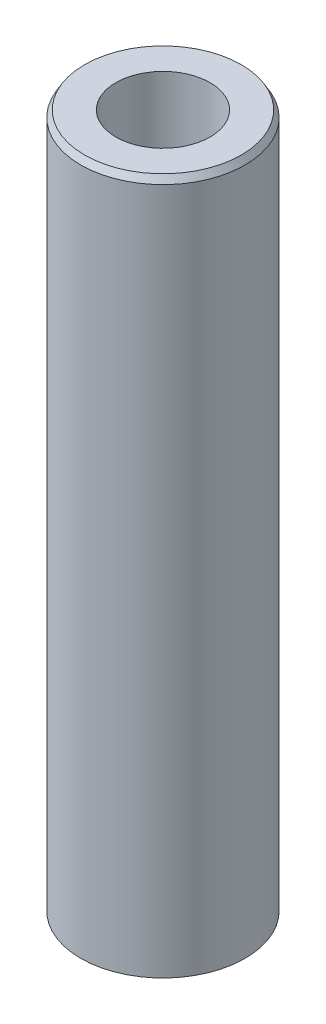
ISO-10303-21;
HEADER;
FILE_DESCRIPTION(('STEP AP214'),'2;1');
FILE_NAME('part.step','',(''),(''),'','','');
FILE_SCHEMA(('AUTOMOTIVE_DESIGN { 1 0 10303 214 1 1 1 1 }'));
ENDSEC;
DATA;
#1=APPLICATION_CONTEXT('core data for automotive mechanical design processes');
#2=APPLICATION_PROTOCOL_DEFINITION('international standard','automotive_design',2000,#1);
#3=PRODUCT_CONTEXT('',#1,'mechanical');
#4=PRODUCT('Part','Part','',(#3));
#5=PRODUCT_RELATED_PRODUCT_CATEGORY('part','',(#4));
#6=PRODUCT_DEFINITION_FORMATION('','',#4);
#7=PRODUCT_DEFINITION_CONTEXT('part definition',#1,'design');
#8=PRODUCT_DEFINITION('design','',#6,#7);
#9=PRODUCT_DEFINITION_SHAPE('','',#8);
#10=(LENGTH_UNIT() NAMED_UNIT(*) SI_UNIT(.MILLI.,.METRE.));
#11=(NAMED_UNIT(*) PLANE_ANGLE_UNIT() SI_UNIT($,.RADIAN.));
#12=(NAMED_UNIT(*) SI_UNIT($,.STERADIAN.) SOLID_ANGLE_UNIT());
#13=UNCERTAINTY_MEASURE_WITH_UNIT(LENGTH_MEASURE(1.E-05),#10,'distance_accuracy_value','');
#14=(GEOMETRIC_REPRESENTATION_CONTEXT(3) GLOBAL_UNCERTAINTY_ASSIGNED_CONTEXT((#13)) GLOBAL_UNIT_ASSIGNED_CONTEXT((#10,
#11,#12)) REPRESENTATION_CONTEXT('',''));
#15=CARTESIAN_POINT('',(0.,0.,0.));
#16=DIRECTION('',(0.,0.,1.));
#17=DIRECTION('',(1.,0.,0.));
#18=AXIS2_PLACEMENT_3D('',#15,#16,#17);
#19=CARTESIAN_POINT('',(0.,488.098273099649,0.));
#20=DIRECTION('',(0.,-1.,0.));
#21=DIRECTION('',(0.,0.,-1.));
#22=AXIS2_PLACEMENT_3D('',#19,#20,#21);
#23=CYLINDRICAL_SURFACE('',#22,57.5);
#24=CARTESIAN_POINT('',(0.,483.416938050981,0.));
#25=DIRECTION('',(0.,1.,0.));
#26=DIRECTION('',(0.,0.,1.));
#27=AXIS2_PLACEMENT_3D('',#24,#25,#26);
#28=CIRCLE('',#27,57.5);
#29=CARTESIAN_POINT('',(0.,483.416938050981,57.5));
#30=VERTEX_POINT('',#29);
#31=EDGE_CURVE('E50',#30,#30,#28,.F.);
#32=ORIENTED_EDGE('',*,*,#31,.T.);
#33=EDGE_LOOP('',(#32));
#34=FACE_BOUND('',#33,.T.);
#35=CARTESIAN_POINT('',(0.,2.70277005051539,0.));
#36=DIRECTION('',(0.,1.,0.));
#37=DIRECTION('',(0.,0.,1.));
#38=AXIS2_PLACEMENT_3D('',#35,#36,#37);
#39=CIRCLE('',#38,57.5);
#40=CARTESIAN_POINT('',(0.,2.70277005051539,57.5));
#41=VERTEX_POINT('',#40);
#42=EDGE_CURVE('E51',#41,#41,#39,.T.);
#43=ORIENTED_EDGE('',*,*,#42,.T.);
#44=EDGE_LOOP('',(#43));
#45=FACE_BOUND('',#44,.T.);
#46=ADVANCED_FACE('F39',(#34,#45),#23,.T.);
#47=CARTESIAN_POINT('',(0.,488.098273099649,0.));
#48=DIRECTION('',(0.,1.,0.));
#49=DIRECTION('',(0.,0.,1.));
#50=AXIS2_PLACEMENT_3D('',#47,#48,#49);
#51=PLANE('',#50);
#52=CARTESIAN_POINT('',(0.,488.098273099649,0.));
#53=DIRECTION('',(0.,1.,0.));
#54=DIRECTION('',(0.,0.,1.));
#55=AXIS2_PLACEMENT_3D('',#52,#53,#54);
#56=CIRCLE('',#55,54.7972299494846);
#57=CARTESIAN_POINT('',(0.,488.098273099649,54.7972299494846));
#58=VERTEX_POINT('',#57);
#59=EDGE_CURVE('E54',#58,#58,#56,.T.);
#60=ORIENTED_EDGE('',*,*,#59,.T.);
#61=EDGE_LOOP('',(#60));
#62=FACE_BOUND('',#61,.T.);
#63=CARTESIAN_POINT('',(0.,488.098273099649,0.));
#64=DIRECTION('',(0.,1.,0.));
#65=DIRECTION('',(0.,0.,1.));
#66=AXIS2_PLACEMENT_3D('',#63,#64,#65);
#67=CIRCLE('',#66,32.9704578937027);
#68=CARTESIAN_POINT('',(0.,488.098273099649,32.9704578937027));
#69=VERTEX_POINT('',#68);
#70=EDGE_CURVE('E58',#69,#69,#67,.T.);
#71=ORIENTED_EDGE('',*,*,#70,.F.);
#72=EDGE_LOOP('',(#71));
#73=FACE_BOUND('',#72,.T.);
#74=ADVANCED_FACE('F69',(#62,#73),#51,.T.);
#75=CARTESIAN_POINT('',(0.,0.,0.));
#76=DIRECTION('',(0.,1.,0.));
#77=DIRECTION('',(0.,0.,1.));
#78=AXIS2_PLACEMENT_3D('',#75,#76,#77);
#79=PLANE('',#78);
#80=CARTESIAN_POINT('',(0.,0.,0.));
#81=DIRECTION('',(0.,1.,0.));
#82=DIRECTION('',(0.,0.,1.));
#83=AXIS2_PLACEMENT_3D('',#80,#81,#82);
#84=CIRCLE('',#83,52.8186649513318);
#85=CARTESIAN_POINT('',(0.,0.,52.8186649513318));
#86=VERTEX_POINT('',#85);
#87=EDGE_CURVE('E10',#86,#86,#84,.F.);
#88=ORIENTED_EDGE('',*,*,#87,.T.);
#89=EDGE_LOOP('',(#88));
#90=FACE_BOUND('',#89,.T.);
#91=CARTESIAN_POINT('',(0.,0.,0.));
#92=DIRECTION('',(0.,1.,0.));
#93=DIRECTION('',(0.,0.,1.));
#94=AXIS2_PLACEMENT_3D('',#91,#92,#93);
#95=CIRCLE('',#94,32.9704578937027);
#96=CARTESIAN_POINT('',(0.,0.,32.9704578937027));
#97=VERTEX_POINT('',#96);
#98=EDGE_CURVE('E63',#97,#97,#95,.T.);
#99=ORIENTED_EDGE('',*,*,#98,.T.);
#100=EDGE_LOOP('',(#99));
#101=FACE_BOUND('',#100,.T.);
#102=ADVANCED_FACE('F75',(#90,#101),#79,.F.);
#103=CARTESIAN_POINT('',(0.,488.098273099649,0.));
#104=DIRECTION('',(0.,-1.,0.));
#105=DIRECTION('',(0.,0.,-1.));
#106=AXIS2_PLACEMENT_3D('',#103,#104,#105);
#107=CYLINDRICAL_SURFACE('',#106,32.9704578937027);
#108=ORIENTED_EDGE('',*,*,#70,.T.);
#109=EDGE_LOOP('',(#108));
#110=FACE_BOUND('',#109,.T.);
#111=ORIENTED_EDGE('',*,*,#98,.F.);
#112=EDGE_LOOP('',(#111));
#113=FACE_BOUND('',#112,.T.);
#114=ADVANCED_FACE('F70',(#110,#113),#107,.F.);
#115=CARTESIAN_POINT('',(0.,488.098273099649,0.));
#116=DIRECTION('',(0.,-1.,0.));
#117=DIRECTION('',(0.,0.,-1.));
#118=AXIS2_PLACEMENT_3D('',#115,#116,#117);
#119=CONICAL_SURFACE('',#118,54.7972299494846,0.523598775598307);
#120=ORIENTED_EDGE('',*,*,#31,.F.);
#121=EDGE_LOOP('',(#120));
#122=FACE_BOUND('',#121,.T.);
#123=ORIENTED_EDGE('',*,*,#59,.F.);
#124=EDGE_LOOP('',(#123));
#125=FACE_BOUND('',#124,.T.);
#126=ADVANCED_FACE('F81',(#122,#125),#119,.T.);
#127=CARTESIAN_POINT('',(0.,2.70277005051539,0.));
#128=DIRECTION('',(0.,1.,0.));
#129=DIRECTION('',(0.,0.,1.));
#130=AXIS2_PLACEMENT_3D('',#127,#128,#129);
#131=CONICAL_SURFACE('',#130,57.5,1.0471975511966);
#132=ORIENTED_EDGE('',*,*,#87,.F.);
#133=EDGE_LOOP('',(#132));
#134=FACE_BOUND('',#133,.T.);
#135=ORIENTED_EDGE('',*,*,#42,.F.);
#136=EDGE_LOOP('',(#135));
#137=FACE_BOUND('',#136,.T.);
#138=ADVANCED_FACE('F45',(#134,#137),#131,.T.);
#139=CLOSED_SHELL('',(#46,#74,#102,#114,#126,#138));
#140=MANIFOLD_SOLID_BREP('B2',#139);
#141=ADVANCED_BREP_SHAPE_REPRESENTATION('',(#18,#140),#14);
#142=SHAPE_DEFINITION_REPRESENTATION(#9,#141);
ENDSEC;
END-ISO-10303-21;
